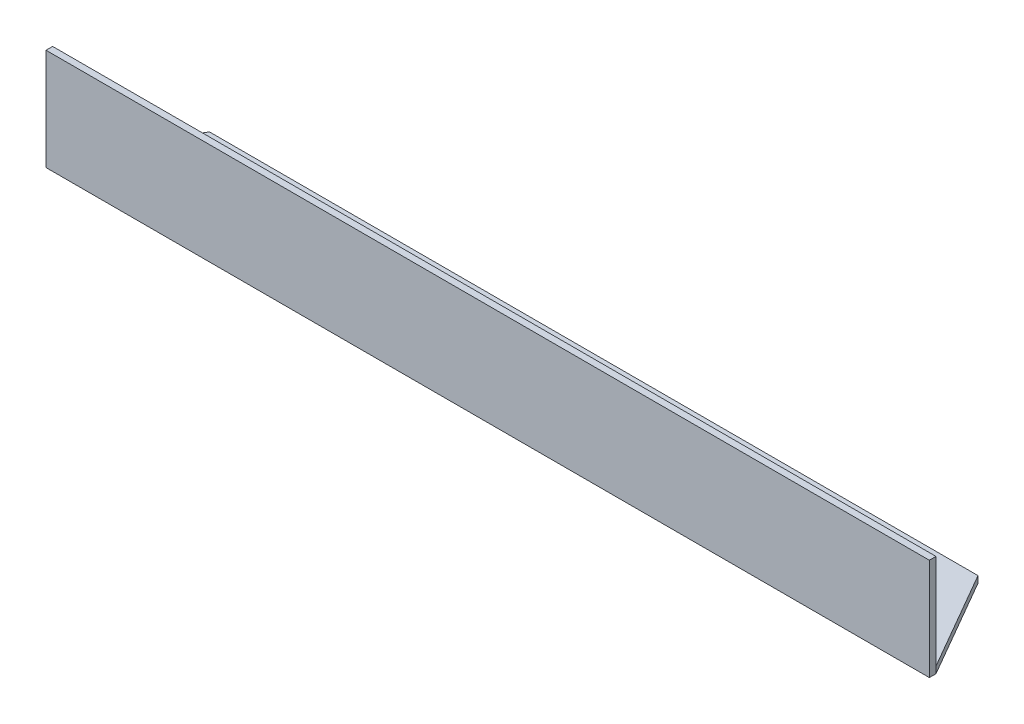
ISO-10303-21;
HEADER;
FILE_DESCRIPTION(('STEP AP214'),'2;1');
FILE_NAME('part.step','',(''),(''),'','','');
FILE_SCHEMA(('AUTOMOTIVE_DESIGN { 1 0 10303 214 1 1 1 1 }'));
ENDSEC;
DATA;
#1=APPLICATION_CONTEXT('core data for automotive mechanical design processes');
#2=APPLICATION_PROTOCOL_DEFINITION('international standard','automotive_design',2000,#1);
#3=PRODUCT_CONTEXT('',#1,'mechanical');
#4=PRODUCT('Part','Part','',(#3));
#5=PRODUCT_RELATED_PRODUCT_CATEGORY('part','',(#4));
#6=PRODUCT_DEFINITION_FORMATION('','',#4);
#7=PRODUCT_DEFINITION_CONTEXT('part definition',#1,'design');
#8=PRODUCT_DEFINITION('design','',#6,#7);
#9=PRODUCT_DEFINITION_SHAPE('','',#8);
#10=(LENGTH_UNIT() NAMED_UNIT(*) SI_UNIT(.MILLI.,.METRE.));
#11=(NAMED_UNIT(*) PLANE_ANGLE_UNIT() SI_UNIT($,.RADIAN.));
#12=(NAMED_UNIT(*) SI_UNIT($,.STERADIAN.) SOLID_ANGLE_UNIT());
#13=UNCERTAINTY_MEASURE_WITH_UNIT(LENGTH_MEASURE(1.E-05),#10,'distance_accuracy_value','');
#14=(GEOMETRIC_REPRESENTATION_CONTEXT(3) GLOBAL_UNCERTAINTY_ASSIGNED_CONTEXT((#13)) GLOBAL_UNIT_ASSIGNED_CONTEXT((#10,
#11,#12)) REPRESENTATION_CONTEXT('',''));
#15=CARTESIAN_POINT('',(0.,0.,0.));
#16=DIRECTION('',(0.,0.,1.));
#17=DIRECTION('',(1.,0.,0.));
#18=AXIS2_PLACEMENT_3D('',#15,#16,#17);
#19=CARTESIAN_POINT('',(0.,0.,0.));
#20=DIRECTION('',(0.,0.,1.));
#21=DIRECTION('',(1.,0.,0.));
#22=AXIS2_PLACEMENT_3D('',#19,#20,#21);
#23=PLANE('',#22);
#24=DIRECTION('',(1.,0.,0.));
#25=VECTOR('',#24,1.);
#26=CARTESIAN_POINT('',(-60.7802841291818,1.5,0.));
#27=LINE('',#26,#25);
#28=CARTESIAN_POINT('',(-60.7802841291818,1.5,0.));
#29=VERTEX_POINT('',#28);
#30=CARTESIAN_POINT('',(139.219715870818,1.5,0.));
#31=VERTEX_POINT('',#30);
#32=EDGE_CURVE('E55',#29,#31,#27,.T.);
#33=ORIENTED_EDGE('',*,*,#32,.F.);
#34=DIRECTION('',(0.,1.,0.));
#35=VECTOR('',#34,1.);
#36=CARTESIAN_POINT('',(-60.7802841291818,0.,0.));
#37=LINE('',#36,#35);
#38=CARTESIAN_POINT('',(-60.7802841291818,23.014216904599,0.));
#39=VERTEX_POINT('',#38);
#40=EDGE_CURVE('E171',#29,#39,#37,.T.);
#41=ORIENTED_EDGE('',*,*,#40,.T.);
#42=DIRECTION('',(1.,0.,0.));
#43=VECTOR('',#42,1.);
#44=CARTESIAN_POINT('',(-60.7802841291818,23.014216904599,0.));
#45=LINE('',#44,#43);
#46=CARTESIAN_POINT('',(139.219715870818,23.014216904599,0.));
#47=VERTEX_POINT('',#46);
#48=EDGE_CURVE('E114',#39,#47,#45,.T.);
#49=ORIENTED_EDGE('',*,*,#48,.T.);
#50=DIRECTION('',(0.,1.,0.));
#51=VECTOR('',#50,1.);
#52=CARTESIAN_POINT('',(139.219715870818,0.,0.));
#53=LINE('',#52,#51);
#54=EDGE_CURVE('E106',#31,#47,#53,.T.);
#55=ORIENTED_EDGE('',*,*,#54,.F.);
#56=EDGE_LOOP('',(#33,#41,#49,#55));
#57=FACE_BOUND('',#56,.T.);
#58=ADVANCED_FACE('F39',(#57),#23,.F.);
#59=CARTESIAN_POINT('',(-60.7802841291818,0.,1.5));
#60=DIRECTION('',(0.,1.,0.));
#61=DIRECTION('',(0.,0.,1.));
#62=AXIS2_PLACEMENT_3D('',#59,#60,#61);
#63=PLANE('',#62);
#64=DIRECTION('',(0.,0.,-1.));
#65=VECTOR('',#64,1.);
#66=CARTESIAN_POINT('',(-60.7802841291818,0.,1.5));
#67=LINE('',#66,#65);
#68=CARTESIAN_POINT('',(-60.7802841291818,0.,1.5));
#69=VERTEX_POINT('',#68);
#70=CARTESIAN_POINT('',(-60.7802841291818,0.,0.));
#71=VERTEX_POINT('',#70);
#72=EDGE_CURVE('E64',#69,#71,#67,.T.);
#73=ORIENTED_EDGE('',*,*,#72,.T.);
#74=DIRECTION('',(-0.499999999999998,0.,0.86602540378444));
#75=VECTOR('',#74,1.);
#76=CARTESIAN_POINT('',(-47.7841008027812,0.,-22.5100498258055));
#77=LINE('',#76,#75);
#78=CARTESIAN_POINT('',(-47.7841008027812,0.,-22.5100498258055));
#79=VERTEX_POINT('',#78);
#80=EDGE_CURVE('E141',#79,#71,#77,.T.);
#81=ORIENTED_EDGE('',*,*,#80,.F.);
#82=DIRECTION('',(1.,0.,0.));
#83=VECTOR('',#82,1.);
#84=CARTESIAN_POINT('',(-47.7841008027812,0.,-22.5100498258055));
#85=LINE('',#84,#83);
#86=CARTESIAN_POINT('',(126.223179020486,0.,-22.5100498258055));
#87=VERTEX_POINT('',#86);
#88=EDGE_CURVE('E148',#79,#87,#85,.T.);
#89=ORIENTED_EDGE('',*,*,#88,.T.);
#90=DIRECTION('',(-0.500010200696507,0.,-0.866019514329463));
#91=VECTOR('',#90,1.);
#92=CARTESIAN_POINT('',(139.219715870818,0.,0.));
#93=LINE('',#92,#91);
#94=CARTESIAN_POINT('',(139.219715870818,0.,0.));
#95=VERTEX_POINT('',#94);
#96=EDGE_CURVE('E145',#95,#87,#93,.T.);
#97=ORIENTED_EDGE('',*,*,#96,.F.);
#98=DIRECTION('',(0.,0.,-1.));
#99=VECTOR('',#98,1.);
#100=CARTESIAN_POINT('',(139.219715870818,0.,1.5));
#101=LINE('',#100,#99);
#102=CARTESIAN_POINT('',(139.219715870818,0.,1.5));
#103=VERTEX_POINT('',#102);
#104=EDGE_CURVE('E11',#103,#95,#101,.T.);
#105=ORIENTED_EDGE('',*,*,#104,.F.);
#106=DIRECTION('',(1.,0.,0.));
#107=VECTOR('',#106,1.);
#108=CARTESIAN_POINT('',(-60.7802841291818,0.,1.5));
#109=LINE('',#108,#107);
#110=EDGE_CURVE('E156',#69,#103,#109,.T.);
#111=ORIENTED_EDGE('',*,*,#110,.F.);
#112=EDGE_LOOP('',(#73,#81,#89,#97,#105,#111));
#113=FACE_BOUND('',#112,.T.);
#114=ADVANCED_FACE('F41',(#113),#63,.F.);
#115=CARTESIAN_POINT('',(139.219715870818,0.,1.5));
#116=DIRECTION('',(-1.,0.,0.));
#117=DIRECTION('',(0.,0.,1.));
#118=AXIS2_PLACEMENT_3D('',#115,#116,#117);
#119=PLANE('',#118);
#120=EDGE_CURVE('E104',#95,#31,#53,.T.);
#121=ORIENTED_EDGE('',*,*,#120,.T.);
#122=ORIENTED_EDGE('',*,*,#54,.T.);
#123=DIRECTION('',(0.,0.,-1.));
#124=VECTOR('',#123,1.);
#125=CARTESIAN_POINT('',(139.219715870818,23.014216904599,1.5));
#126=LINE('',#125,#124);
#127=CARTESIAN_POINT('',(139.219715870818,23.014216904599,1.5));
#128=VERTEX_POINT('',#127);
#129=EDGE_CURVE('E48',#128,#47,#126,.T.);
#130=ORIENTED_EDGE('',*,*,#129,.F.);
#131=DIRECTION('',(0.,1.,0.));
#132=VECTOR('',#131,1.);
#133=CARTESIAN_POINT('',(139.219715870818,0.,1.5));
#134=LINE('',#133,#132);
#135=EDGE_CURVE('E87',#103,#128,#134,.T.);
#136=ORIENTED_EDGE('',*,*,#135,.F.);
#137=ORIENTED_EDGE('',*,*,#104,.T.);
#138=EDGE_LOOP('',(#121,#122,#130,#136,#137));
#139=FACE_BOUND('',#138,.T.);
#140=ADVANCED_FACE('F105',(#139),#119,.F.);
#141=CARTESIAN_POINT('',(-60.7802841291818,23.014216904599,1.5));
#142=DIRECTION('',(0.,1.,0.));
#143=DIRECTION('',(0.,0.,1.));
#144=AXIS2_PLACEMENT_3D('',#141,#142,#143);
#145=PLANE('',#144);
#146=ORIENTED_EDGE('',*,*,#48,.F.);
#147=DIRECTION('',(0.,0.,-1.));
#148=VECTOR('',#147,1.);
#149=CARTESIAN_POINT('',(-60.7802841291818,23.014216904599,1.5));
#150=LINE('',#149,#148);
#151=CARTESIAN_POINT('',(-60.7802841291818,23.014216904599,1.5));
#152=VERTEX_POINT('',#151);
#153=EDGE_CURVE('E176',#152,#39,#150,.T.);
#154=ORIENTED_EDGE('',*,*,#153,.F.);
#155=DIRECTION('',(1.,0.,0.));
#156=VECTOR('',#155,1.);
#157=CARTESIAN_POINT('',(-60.7802841291818,23.014216904599,1.5));
#158=LINE('',#157,#156);
#159=EDGE_CURVE('E162',#152,#128,#158,.T.);
#160=ORIENTED_EDGE('',*,*,#159,.T.);
#161=ORIENTED_EDGE('',*,*,#129,.T.);
#162=EDGE_LOOP('',(#146,#154,#160,#161));
#163=FACE_BOUND('',#162,.T.);
#164=ADVANCED_FACE('F181',(#163),#145,.T.);
#165=CARTESIAN_POINT('',(-60.7802841291818,0.,1.5));
#166=DIRECTION('',(-1.,0.,0.));
#167=DIRECTION('',(0.,0.,1.));
#168=AXIS2_PLACEMENT_3D('',#165,#166,#167);
#169=PLANE('',#168);
#170=EDGE_CURVE('E159',#71,#29,#37,.T.);
#171=ORIENTED_EDGE('',*,*,#170,.F.);
#172=ORIENTED_EDGE('',*,*,#72,.F.);
#173=DIRECTION('',(0.,1.,0.));
#174=VECTOR('',#173,1.);
#175=CARTESIAN_POINT('',(-60.7802841291818,0.,1.5));
#176=LINE('',#175,#174);
#177=EDGE_CURVE('E166',#69,#152,#176,.T.);
#178=ORIENTED_EDGE('',*,*,#177,.T.);
#179=ORIENTED_EDGE('',*,*,#153,.T.);
#180=ORIENTED_EDGE('',*,*,#40,.F.);
#181=EDGE_LOOP('',(#171,#172,#178,#179,#180));
#182=FACE_BOUND('',#181,.T.);
#183=ADVANCED_FACE('F186',(#182),#169,.T.);
#184=CARTESIAN_POINT('',(0.,0.,1.5));
#185=DIRECTION('',(0.,0.,1.));
#186=DIRECTION('',(1.,0.,0.));
#187=AXIS2_PLACEMENT_3D('',#184,#185,#186);
#188=PLANE('',#187);
#189=ORIENTED_EDGE('',*,*,#110,.T.);
#190=ORIENTED_EDGE('',*,*,#135,.T.);
#191=ORIENTED_EDGE('',*,*,#159,.F.);
#192=ORIENTED_EDGE('',*,*,#177,.F.);
#193=EDGE_LOOP('',(#189,#190,#191,#192));
#194=FACE_BOUND('',#193,.T.);
#195=ADVANCED_FACE('F185',(#194),#188,.T.);
#196=CARTESIAN_POINT('',(-47.7841008027812,1.5,-22.5100498258055));
#197=DIRECTION('',(0.86602540378444,0.,0.499999999999998));
#198=DIRECTION('',(0.499999999999998,0.,-0.86602540378444));
#199=AXIS2_PLACEMENT_3D('',#196,#197,#198);
#200=PLANE('',#199);
#201=ORIENTED_EDGE('',*,*,#80,.T.);
#202=ORIENTED_EDGE('',*,*,#170,.T.);
#203=DIRECTION('',(-0.499999999999998,0.,0.86602540378444));
#204=VECTOR('',#203,1.);
#205=CARTESIAN_POINT('',(-47.7841008027812,1.5,-22.5100498258055));
#206=LINE('',#205,#204);
#207=CARTESIAN_POINT('',(-47.7841008027812,1.5,-22.5100498258055));
#208=VERTEX_POINT('',#207);
#209=EDGE_CURVE('E127',#208,#29,#206,.T.);
#210=ORIENTED_EDGE('',*,*,#209,.F.);
#211=DIRECTION('',(0.,-1.,0.));
#212=VECTOR('',#211,1.);
#213=CARTESIAN_POINT('',(-47.7841008027812,1.5,-22.5100498258055));
#214=LINE('',#213,#212);
#215=EDGE_CURVE('E137',#208,#79,#214,.T.);
#216=ORIENTED_EDGE('',*,*,#215,.T.);
#217=EDGE_LOOP('',(#201,#202,#210,#216));
#218=FACE_BOUND('',#217,.T.);
#219=ADVANCED_FACE('F189',(#218),#200,.F.);
#220=CARTESIAN_POINT('',(139.219715870818,1.5,0.));
#221=DIRECTION('',(-0.866019514329463,0.,0.500010200696507));
#222=DIRECTION('',(0.500010200696507,0.,0.866019514329463));
#223=AXIS2_PLACEMENT_3D('',#220,#221,#222);
#224=PLANE('',#223);
#225=ORIENTED_EDGE('',*,*,#96,.T.);
#226=DIRECTION('',(0.,-1.,0.));
#227=VECTOR('',#226,1.);
#228=CARTESIAN_POINT('',(126.223179020486,1.5,-22.5100498258055));
#229=LINE('',#228,#227);
#230=CARTESIAN_POINT('',(126.223179020486,1.5,-22.5100498258055));
#231=VERTEX_POINT('',#230);
#232=EDGE_CURVE('E119',#231,#87,#229,.T.);
#233=ORIENTED_EDGE('',*,*,#232,.F.);
#234=DIRECTION('',(-0.500010200696507,0.,-0.866019514329463));
#235=VECTOR('',#234,1.);
#236=CARTESIAN_POINT('',(139.219715870818,1.5,0.));
#237=LINE('',#236,#235);
#238=EDGE_CURVE('E124',#31,#231,#237,.T.);
#239=ORIENTED_EDGE('',*,*,#238,.F.);
#240=ORIENTED_EDGE('',*,*,#120,.F.);
#241=EDGE_LOOP('',(#225,#233,#239,#240));
#242=FACE_BOUND('',#241,.T.);
#243=ADVANCED_FACE('F131',(#242),#224,.F.);
#244=CARTESIAN_POINT('',(-47.7841008027812,1.5,-22.5100498258055));
#245=DIRECTION('',(0.,0.,-1.));
#246=DIRECTION('',(-1.,0.,0.));
#247=AXIS2_PLACEMENT_3D('',#244,#245,#246);
#248=PLANE('',#247);
#249=ORIENTED_EDGE('',*,*,#88,.F.);
#250=ORIENTED_EDGE('',*,*,#215,.F.);
#251=DIRECTION('',(1.,0.,0.));
#252=VECTOR('',#251,1.);
#253=CARTESIAN_POINT('',(-47.7841008027812,1.5,-22.5100498258055));
#254=LINE('',#253,#252);
#255=EDGE_CURVE('E134',#208,#231,#254,.T.);
#256=ORIENTED_EDGE('',*,*,#255,.T.);
#257=ORIENTED_EDGE('',*,*,#232,.T.);
#258=EDGE_LOOP('',(#249,#250,#256,#257));
#259=FACE_BOUND('',#258,.T.);
#260=ADVANCED_FACE('F192',(#259),#248,.T.);
#261=CARTESIAN_POINT('',(0.,1.5,0.));
#262=DIRECTION('',(0.,-1.,0.));
#263=DIRECTION('',(0.,0.,-1.));
#264=AXIS2_PLACEMENT_3D('',#261,#262,#263);
#265=PLANE('',#264);
#266=ORIENTED_EDGE('',*,*,#209,.T.);
#267=ORIENTED_EDGE('',*,*,#32,.T.);
#268=ORIENTED_EDGE('',*,*,#238,.T.);
#269=ORIENTED_EDGE('',*,*,#255,.F.);
#270=EDGE_LOOP('',(#266,#267,#268,#269));
#271=FACE_BOUND('',#270,.T.);
#272=ADVANCED_FACE('F122',(#271),#265,.F.);
#273=CLOSED_SHELL('',(#58,#114,#140,#164,#183,#195,#219,#243,#260,#272));
#274=MANIFOLD_SOLID_BREP('B2',#273);
#275=ADVANCED_BREP_SHAPE_REPRESENTATION('',(#18,#274),#14);
#276=SHAPE_DEFINITION_REPRESENTATION(#9,#275);
ENDSEC;
END-ISO-10303-21;
